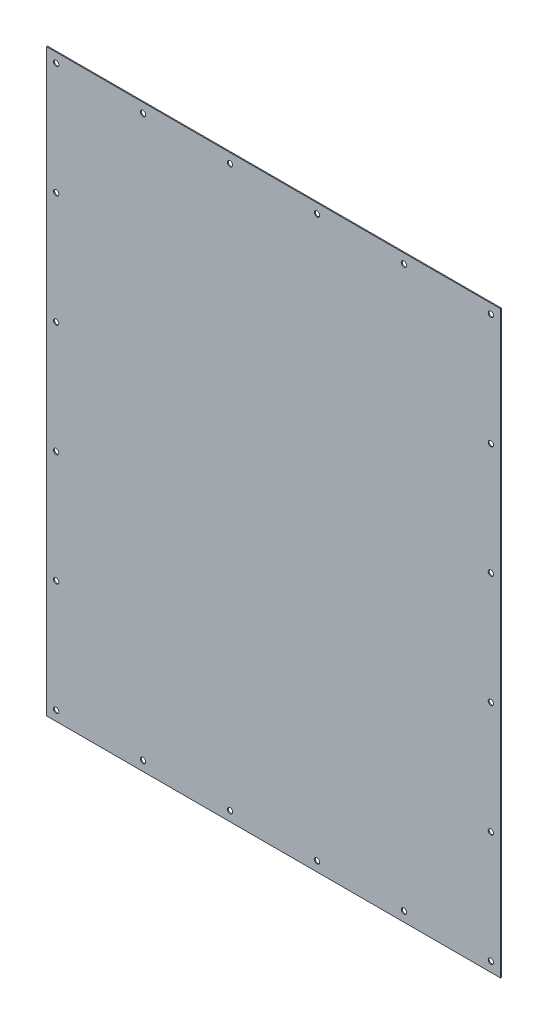
ISO-10303-21;
HEADER;
FILE_DESCRIPTION(('STEP AP214'),'2;1');
FILE_NAME('part.step','',(''),(''),'','','');
FILE_SCHEMA(('AUTOMOTIVE_DESIGN { 1 0 10303 214 1 1 1 1 }'));
ENDSEC;
DATA;
#1=APPLICATION_CONTEXT('core data for automotive mechanical design processes');
#2=APPLICATION_PROTOCOL_DEFINITION('international standard','automotive_design',2000,#1);
#3=PRODUCT_CONTEXT('',#1,'mechanical');
#4=PRODUCT('Part','Part','',(#3));
#5=PRODUCT_RELATED_PRODUCT_CATEGORY('part','',(#4));
#6=PRODUCT_DEFINITION_FORMATION('','',#4);
#7=PRODUCT_DEFINITION_CONTEXT('part definition',#1,'design');
#8=PRODUCT_DEFINITION('design','',#6,#7);
#9=PRODUCT_DEFINITION_SHAPE('','',#8);
#10=(LENGTH_UNIT() NAMED_UNIT(*) SI_UNIT(.MILLI.,.METRE.));
#11=(NAMED_UNIT(*) PLANE_ANGLE_UNIT() SI_UNIT($,.RADIAN.));
#12=(NAMED_UNIT(*) SI_UNIT($,.STERADIAN.) SOLID_ANGLE_UNIT());
#13=UNCERTAINTY_MEASURE_WITH_UNIT(LENGTH_MEASURE(1.E-05),#10,'distance_accuracy_value','');
#14=(GEOMETRIC_REPRESENTATION_CONTEXT(3) GLOBAL_UNCERTAINTY_ASSIGNED_CONTEXT((#13)) GLOBAL_UNIT_ASSIGNED_CONTEXT((#10,
#11,#12)) REPRESENTATION_CONTEXT('',''));
#15=CARTESIAN_POINT('',(0.,0.,0.));
#16=DIRECTION('',(0.,0.,1.));
#17=DIRECTION('',(1.,0.,0.));
#18=AXIS2_PLACEMENT_3D('',#15,#16,#17);
#19=CARTESIAN_POINT('',(0.,0.,0.));
#20=DIRECTION('',(0.,0.,-1.));
#21=DIRECTION('',(-1.,0.,0.));
#22=AXIS2_PLACEMENT_3D('',#19,#20,#21);
#23=PLANE('',#22);
#24=CARTESIAN_POINT('',(-135.,-290.,0.));
#25=DIRECTION('',(0.,0.,1.));
#26=DIRECTION('',(1.,0.,0.));
#27=AXIS2_PLACEMENT_3D('',#24,#25,#26);
#28=CIRCLE('',#27,2.74999999999997);
#29=CARTESIAN_POINT('',(-132.25,-290.,0.));
#30=VERTEX_POINT('',#29);
#31=EDGE_CURVE('E313',#30,#30,#28,.T.);
#32=ORIENTED_EDGE('',*,*,#31,.T.);
#33=EDGE_LOOP('',(#32));
#34=FACE_BOUND('',#33,.T.);
#35=CARTESIAN_POINT('',(-225.,-290.,0.));
#36=DIRECTION('',(0.,0.,1.));
#37=DIRECTION('',(1.,0.,0.));
#38=AXIS2_PLACEMENT_3D('',#35,#36,#37);
#39=CIRCLE('',#38,2.74999999999997);
#40=CARTESIAN_POINT('',(-222.25,-290.,0.));
#41=VERTEX_POINT('',#40);
#42=EDGE_CURVE('E318',#41,#41,#39,.T.);
#43=ORIENTED_EDGE('',*,*,#42,.T.);
#44=EDGE_LOOP('',(#43));
#45=FACE_BOUND('',#44,.T.);
#46=CARTESIAN_POINT('',(-225.,-174.,0.));
#47=DIRECTION('',(0.,0.,1.));
#48=DIRECTION('',(1.,0.,0.));
#49=AXIS2_PLACEMENT_3D('',#46,#47,#48);
#50=CIRCLE('',#49,2.74999999999997);
#51=CARTESIAN_POINT('',(-222.25,-174.,0.));
#52=VERTEX_POINT('',#51);
#53=EDGE_CURVE('E324',#52,#52,#50,.T.);
#54=ORIENTED_EDGE('',*,*,#53,.T.);
#55=EDGE_LOOP('',(#54));
#56=FACE_BOUND('',#55,.T.);
#57=CARTESIAN_POINT('',(-225.,-58.0000000000001,0.));
#58=DIRECTION('',(0.,0.,1.));
#59=DIRECTION('',(1.,0.,0.));
#60=AXIS2_PLACEMENT_3D('',#57,#58,#59);
#61=CIRCLE('',#60,2.74999999999997);
#62=CARTESIAN_POINT('',(-222.25,-58.0000000000001,0.));
#63=VERTEX_POINT('',#62);
#64=EDGE_CURVE('E330',#63,#63,#61,.T.);
#65=ORIENTED_EDGE('',*,*,#64,.T.);
#66=EDGE_LOOP('',(#65));
#67=FACE_BOUND('',#66,.T.);
#68=CARTESIAN_POINT('',(-225.,174.,0.));
#69=DIRECTION('',(0.,0.,1.));
#70=DIRECTION('',(1.,0.,0.));
#71=AXIS2_PLACEMENT_3D('',#68,#69,#70);
#72=CIRCLE('',#71,2.74999999999997);
#73=CARTESIAN_POINT('',(-222.25,174.,0.));
#74=VERTEX_POINT('',#73);
#75=EDGE_CURVE('E336',#74,#74,#72,.T.);
#76=ORIENTED_EDGE('',*,*,#75,.T.);
#77=EDGE_LOOP('',(#76));
#78=FACE_BOUND('',#77,.T.);
#79=CARTESIAN_POINT('',(-225.,57.9999999999999,0.));
#80=DIRECTION('',(0.,0.,1.));
#81=DIRECTION('',(1.,0.,0.));
#82=AXIS2_PLACEMENT_3D('',#79,#80,#81);
#83=CIRCLE('',#82,2.74999999999997);
#84=CARTESIAN_POINT('',(-222.25,57.9999999999999,0.));
#85=VERTEX_POINT('',#84);
#86=EDGE_CURVE('E109',#85,#85,#83,.T.);
#87=ORIENTED_EDGE('',*,*,#86,.T.);
#88=EDGE_LOOP('',(#87));
#89=FACE_BOUND('',#88,.T.);
#90=DIRECTION('',(0.,1.,0.));
#91=VECTOR('',#90,1.);
#92=CARTESIAN_POINT('',(-235.,-300.,0.));
#93=LINE('',#92,#91);
#94=CARTESIAN_POINT('',(-235.,-300.,0.));
#95=VERTEX_POINT('',#94);
#96=CARTESIAN_POINT('',(-235.,300.,0.));
#97=VERTEX_POINT('',#96);
#98=EDGE_CURVE('E105',#95,#97,#93,.T.);
#99=ORIENTED_EDGE('',*,*,#98,.T.);
#100=DIRECTION('',(1.,0.,0.));
#101=VECTOR('',#100,1.);
#102=CARTESIAN_POINT('',(-235.,300.,0.));
#103=LINE('',#102,#101);
#104=CARTESIAN_POINT('',(235.,300.,0.));
#105=VERTEX_POINT('',#104);
#106=EDGE_CURVE('E108',#97,#105,#103,.T.);
#107=ORIENTED_EDGE('',*,*,#106,.T.);
#108=DIRECTION('',(0.,1.,0.));
#109=VECTOR('',#108,1.);
#110=CARTESIAN_POINT('',(235.,-300.,0.));
#111=LINE('',#110,#109);
#112=CARTESIAN_POINT('',(235.,-300.,0.));
#113=VERTEX_POINT('',#112);
#114=EDGE_CURVE('E96',#113,#105,#111,.T.);
#115=ORIENTED_EDGE('',*,*,#114,.F.);
#116=DIRECTION('',(1.,0.,0.));
#117=VECTOR('',#116,1.);
#118=CARTESIAN_POINT('',(-235.,-300.,0.));
#119=LINE('',#118,#117);
#120=EDGE_CURVE('E71',#95,#113,#119,.T.);
#121=ORIENTED_EDGE('',*,*,#120,.F.);
#122=EDGE_LOOP('',(#99,#107,#115,#121));
#123=FACE_BOUND('',#122,.T.);
#124=CARTESIAN_POINT('',(-45.,-290.,0.));
#125=DIRECTION('',(0.,0.,1.));
#126=DIRECTION('',(1.,0.,0.));
#127=AXIS2_PLACEMENT_3D('',#124,#125,#126);
#128=CIRCLE('',#127,2.74999999999999);
#129=CARTESIAN_POINT('',(-42.2500000000001,-290.,0.));
#130=VERTEX_POINT('',#129);
#131=EDGE_CURVE('E307',#130,#130,#128,.T.);
#132=ORIENTED_EDGE('',*,*,#131,.T.);
#133=EDGE_LOOP('',(#132));
#134=FACE_BOUND('',#133,.T.);
#135=CARTESIAN_POINT('',(45.,-290.,0.));
#136=DIRECTION('',(0.,0.,1.));
#137=DIRECTION('',(1.,0.,0.));
#138=AXIS2_PLACEMENT_3D('',#135,#136,#137);
#139=CIRCLE('',#138,2.74999999999999);
#140=CARTESIAN_POINT('',(47.7499999999999,-290.,0.));
#141=VERTEX_POINT('',#140);
#142=EDGE_CURVE('E301',#141,#141,#139,.T.);
#143=ORIENTED_EDGE('',*,*,#142,.T.);
#144=EDGE_LOOP('',(#143));
#145=FACE_BOUND('',#144,.T.);
#146=CARTESIAN_POINT('',(135.,-290.,0.));
#147=DIRECTION('',(0.,0.,1.));
#148=DIRECTION('',(1.,0.,0.));
#149=AXIS2_PLACEMENT_3D('',#146,#147,#148);
#150=CIRCLE('',#149,2.74999999999997);
#151=CARTESIAN_POINT('',(137.75,-290.,0.));
#152=VERTEX_POINT('',#151);
#153=EDGE_CURVE('E295',#152,#152,#150,.T.);
#154=ORIENTED_EDGE('',*,*,#153,.T.);
#155=EDGE_LOOP('',(#154));
#156=FACE_BOUND('',#155,.T.);
#157=CARTESIAN_POINT('',(225.,-290.,0.));
#158=DIRECTION('',(0.,0.,1.));
#159=DIRECTION('',(1.,0.,0.));
#160=AXIS2_PLACEMENT_3D('',#157,#158,#159);
#161=CIRCLE('',#160,2.74999999999997);
#162=CARTESIAN_POINT('',(227.75,-290.,0.));
#163=VERTEX_POINT('',#162);
#164=EDGE_CURVE('E289',#163,#163,#161,.T.);
#165=ORIENTED_EDGE('',*,*,#164,.T.);
#166=EDGE_LOOP('',(#165));
#167=FACE_BOUND('',#166,.T.);
#168=CARTESIAN_POINT('',(225.,-174.,0.));
#169=DIRECTION('',(0.,0.,1.));
#170=DIRECTION('',(1.,0.,0.));
#171=AXIS2_PLACEMENT_3D('',#168,#169,#170);
#172=CIRCLE('',#171,2.74999999999997);
#173=CARTESIAN_POINT('',(227.75,-174.,0.));
#174=VERTEX_POINT('',#173);
#175=EDGE_CURVE('E283',#174,#174,#172,.T.);
#176=ORIENTED_EDGE('',*,*,#175,.T.);
#177=EDGE_LOOP('',(#176));
#178=FACE_BOUND('',#177,.T.);
#179=CARTESIAN_POINT('',(225.,-58.0000000000001,0.));
#180=DIRECTION('',(0.,0.,1.));
#181=DIRECTION('',(1.,0.,0.));
#182=AXIS2_PLACEMENT_3D('',#179,#180,#181);
#183=CIRCLE('',#182,2.74999999999997);
#184=CARTESIAN_POINT('',(227.75,-58.0000000000001,0.));
#185=VERTEX_POINT('',#184);
#186=EDGE_CURVE('E277',#185,#185,#183,.T.);
#187=ORIENTED_EDGE('',*,*,#186,.T.);
#188=EDGE_LOOP('',(#187));
#189=FACE_BOUND('',#188,.T.);
#190=CARTESIAN_POINT('',(225.,57.9999999999999,0.));
#191=DIRECTION('',(0.,0.,1.));
#192=DIRECTION('',(1.,0.,0.));
#193=AXIS2_PLACEMENT_3D('',#190,#191,#192);
#194=CIRCLE('',#193,2.74999999999997);
#195=CARTESIAN_POINT('',(227.75,57.9999999999999,0.));
#196=VERTEX_POINT('',#195);
#197=EDGE_CURVE('E271',#196,#196,#194,.T.);
#198=ORIENTED_EDGE('',*,*,#197,.T.);
#199=EDGE_LOOP('',(#198));
#200=FACE_BOUND('',#199,.T.);
#201=CARTESIAN_POINT('',(225.,174.,0.));
#202=DIRECTION('',(0.,0.,1.));
#203=DIRECTION('',(1.,0.,0.));
#204=AXIS2_PLACEMENT_3D('',#201,#202,#203);
#205=CIRCLE('',#204,2.74999999999997);
#206=CARTESIAN_POINT('',(227.75,174.,0.));
#207=VERTEX_POINT('',#206);
#208=EDGE_CURVE('E265',#207,#207,#205,.T.);
#209=ORIENTED_EDGE('',*,*,#208,.T.);
#210=EDGE_LOOP('',(#209));
#211=FACE_BOUND('',#210,.T.);
#212=CARTESIAN_POINT('',(225.,290.,0.));
#213=DIRECTION('',(0.,0.,1.));
#214=DIRECTION('',(1.,0.,0.));
#215=AXIS2_PLACEMENT_3D('',#212,#213,#214);
#216=CIRCLE('',#215,2.74999999999997);
#217=CARTESIAN_POINT('',(227.75,290.,0.));
#218=VERTEX_POINT('',#217);
#219=EDGE_CURVE('E259',#218,#218,#216,.T.);
#220=ORIENTED_EDGE('',*,*,#219,.T.);
#221=EDGE_LOOP('',(#220));
#222=FACE_BOUND('',#221,.T.);
#223=CARTESIAN_POINT('',(135.,290.,0.));
#224=DIRECTION('',(0.,0.,1.));
#225=DIRECTION('',(1.,0.,0.));
#226=AXIS2_PLACEMENT_3D('',#223,#224,#225);
#227=CIRCLE('',#226,2.74999999999997);
#228=CARTESIAN_POINT('',(137.75,290.,0.));
#229=VERTEX_POINT('',#228);
#230=EDGE_CURVE('E253',#229,#229,#227,.T.);
#231=ORIENTED_EDGE('',*,*,#230,.T.);
#232=EDGE_LOOP('',(#231));
#233=FACE_BOUND('',#232,.T.);
#234=CARTESIAN_POINT('',(45.,290.,0.));
#235=DIRECTION('',(0.,0.,1.));
#236=DIRECTION('',(1.,0.,0.));
#237=AXIS2_PLACEMENT_3D('',#234,#235,#236);
#238=CIRCLE('',#237,2.74999999999999);
#239=CARTESIAN_POINT('',(47.7499999999999,290.,0.));
#240=VERTEX_POINT('',#239);
#241=EDGE_CURVE('E247',#240,#240,#238,.T.);
#242=ORIENTED_EDGE('',*,*,#241,.T.);
#243=EDGE_LOOP('',(#242));
#244=FACE_BOUND('',#243,.T.);
#245=CARTESIAN_POINT('',(-45.,290.,0.));
#246=DIRECTION('',(0.,0.,1.));
#247=DIRECTION('',(1.,0.,0.));
#248=AXIS2_PLACEMENT_3D('',#245,#246,#247);
#249=CIRCLE('',#248,2.74999999999999);
#250=CARTESIAN_POINT('',(-42.25,290.,0.));
#251=VERTEX_POINT('',#250);
#252=EDGE_CURVE('E241',#251,#251,#249,.T.);
#253=ORIENTED_EDGE('',*,*,#252,.T.);
#254=EDGE_LOOP('',(#253));
#255=FACE_BOUND('',#254,.T.);
#256=CARTESIAN_POINT('',(-135.,290.,0.));
#257=DIRECTION('',(0.,0.,1.));
#258=DIRECTION('',(1.,0.,0.));
#259=AXIS2_PLACEMENT_3D('',#256,#257,#258);
#260=CIRCLE('',#259,2.74999999999997);
#261=CARTESIAN_POINT('',(-132.25,290.,0.));
#262=VERTEX_POINT('',#261);
#263=EDGE_CURVE('E235',#262,#262,#260,.T.);
#264=ORIENTED_EDGE('',*,*,#263,.T.);
#265=EDGE_LOOP('',(#264));
#266=FACE_BOUND('',#265,.T.);
#267=CARTESIAN_POINT('',(-225.,290.,0.));
#268=DIRECTION('',(0.,0.,1.));
#269=DIRECTION('',(1.,0.,0.));
#270=AXIS2_PLACEMENT_3D('',#267,#268,#269);
#271=CIRCLE('',#270,2.74999999999997);
#272=CARTESIAN_POINT('',(-222.25,290.,0.));
#273=VERTEX_POINT('',#272);
#274=EDGE_CURVE('E225',#273,#273,#271,.T.);
#275=ORIENTED_EDGE('',*,*,#274,.T.);
#276=EDGE_LOOP('',(#275));
#277=FACE_BOUND('',#276,.T.);
#278=ADVANCED_FACE('F37',(#34,#45,#56,#67,#78,#89,#123,#134,#145,#156,#167,#178,#189,#200,#211,
#222,#233,#244,#255,#266,#277),#23,.T.);
#279=CARTESIAN_POINT('',(0.,0.,1.));
#280=DIRECTION('',(0.,0.,-1.));
#281=DIRECTION('',(-1.,0.,0.));
#282=AXIS2_PLACEMENT_3D('',#279,#280,#281);
#283=PLANE('',#282);
#284=CARTESIAN_POINT('',(-225.,290.,1.));
#285=DIRECTION('',(0.,0.,1.));
#286=DIRECTION('',(1.,0.,0.));
#287=AXIS2_PLACEMENT_3D('',#284,#285,#286);
#288=CIRCLE('',#287,2.75);
#289=CARTESIAN_POINT('',(-222.25,290.,1.));
#290=VERTEX_POINT('',#289);
#291=EDGE_CURVE('E228',#290,#290,#288,.T.);
#292=ORIENTED_EDGE('',*,*,#291,.F.);
#293=EDGE_LOOP('',(#292));
#294=FACE_BOUND('',#293,.T.);
#295=CARTESIAN_POINT('',(-135.,290.,1.));
#296=DIRECTION('',(0.,0.,1.));
#297=DIRECTION('',(1.,0.,0.));
#298=AXIS2_PLACEMENT_3D('',#295,#296,#297);
#299=CIRCLE('',#298,2.75);
#300=CARTESIAN_POINT('',(-132.25,290.,1.));
#301=VERTEX_POINT('',#300);
#302=EDGE_CURVE('E230',#301,#301,#299,.T.);
#303=ORIENTED_EDGE('',*,*,#302,.F.);
#304=EDGE_LOOP('',(#303));
#305=FACE_BOUND('',#304,.T.);
#306=CARTESIAN_POINT('',(-45.,290.,1.));
#307=DIRECTION('',(0.,0.,1.));
#308=DIRECTION('',(1.,0.,0.));
#309=AXIS2_PLACEMENT_3D('',#306,#307,#308);
#310=CIRCLE('',#309,2.74999999999999);
#311=CARTESIAN_POINT('',(-42.25,290.,1.));
#312=VERTEX_POINT('',#311);
#313=EDGE_CURVE('E238',#312,#312,#310,.T.);
#314=ORIENTED_EDGE('',*,*,#313,.F.);
#315=EDGE_LOOP('',(#314));
#316=FACE_BOUND('',#315,.T.);
#317=CARTESIAN_POINT('',(45.,290.,1.));
#318=DIRECTION('',(0.,0.,1.));
#319=DIRECTION('',(1.,0.,0.));
#320=AXIS2_PLACEMENT_3D('',#317,#318,#319);
#321=CIRCLE('',#320,2.74999999999999);
#322=CARTESIAN_POINT('',(47.7499999999999,290.,1.));
#323=VERTEX_POINT('',#322);
#324=EDGE_CURVE('E244',#323,#323,#321,.T.);
#325=ORIENTED_EDGE('',*,*,#324,.F.);
#326=EDGE_LOOP('',(#325));
#327=FACE_BOUND('',#326,.T.);
#328=CARTESIAN_POINT('',(135.,290.,1.));
#329=DIRECTION('',(0.,0.,1.));
#330=DIRECTION('',(1.,0.,0.));
#331=AXIS2_PLACEMENT_3D('',#328,#329,#330);
#332=CIRCLE('',#331,2.74999999999997);
#333=CARTESIAN_POINT('',(137.75,290.,1.));
#334=VERTEX_POINT('',#333);
#335=EDGE_CURVE('E250',#334,#334,#332,.T.);
#336=ORIENTED_EDGE('',*,*,#335,.F.);
#337=EDGE_LOOP('',(#336));
#338=FACE_BOUND('',#337,.T.);
#339=CARTESIAN_POINT('',(225.,290.,1.));
#340=DIRECTION('',(0.,0.,1.));
#341=DIRECTION('',(1.,0.,0.));
#342=AXIS2_PLACEMENT_3D('',#339,#340,#341);
#343=CIRCLE('',#342,2.75);
#344=CARTESIAN_POINT('',(227.75,290.,1.));
#345=VERTEX_POINT('',#344);
#346=EDGE_CURVE('E256',#345,#345,#343,.T.);
#347=ORIENTED_EDGE('',*,*,#346,.F.);
#348=EDGE_LOOP('',(#347));
#349=FACE_BOUND('',#348,.T.);
#350=CARTESIAN_POINT('',(225.,174.,1.));
#351=DIRECTION('',(0.,0.,1.));
#352=DIRECTION('',(1.,0.,0.));
#353=AXIS2_PLACEMENT_3D('',#350,#351,#352);
#354=CIRCLE('',#353,2.74999999999997);
#355=CARTESIAN_POINT('',(227.75,174.,1.));
#356=VERTEX_POINT('',#355);
#357=EDGE_CURVE('E262',#356,#356,#354,.T.);
#358=ORIENTED_EDGE('',*,*,#357,.F.);
#359=EDGE_LOOP('',(#358));
#360=FACE_BOUND('',#359,.T.);
#361=CARTESIAN_POINT('',(225.,57.9999999999999,1.));
#362=DIRECTION('',(0.,0.,1.));
#363=DIRECTION('',(1.,0.,0.));
#364=AXIS2_PLACEMENT_3D('',#361,#362,#363);
#365=CIRCLE('',#364,2.74999999999997);
#366=CARTESIAN_POINT('',(227.75,57.9999999999999,1.));
#367=VERTEX_POINT('',#366);
#368=EDGE_CURVE('E268',#367,#367,#365,.T.);
#369=ORIENTED_EDGE('',*,*,#368,.F.);
#370=EDGE_LOOP('',(#369));
#371=FACE_BOUND('',#370,.T.);
#372=CARTESIAN_POINT('',(225.,-58.0000000000001,1.));
#373=DIRECTION('',(0.,0.,1.));
#374=DIRECTION('',(1.,0.,0.));
#375=AXIS2_PLACEMENT_3D('',#372,#373,#374);
#376=CIRCLE('',#375,2.74999999999997);
#377=CARTESIAN_POINT('',(227.75,-58.0000000000001,1.));
#378=VERTEX_POINT('',#377);
#379=EDGE_CURVE('E274',#378,#378,#376,.T.);
#380=ORIENTED_EDGE('',*,*,#379,.F.);
#381=EDGE_LOOP('',(#380));
#382=FACE_BOUND('',#381,.T.);
#383=CARTESIAN_POINT('',(225.,-174.,1.));
#384=DIRECTION('',(0.,0.,1.));
#385=DIRECTION('',(1.,0.,0.));
#386=AXIS2_PLACEMENT_3D('',#383,#384,#385);
#387=CIRCLE('',#386,2.74999999999997);
#388=CARTESIAN_POINT('',(227.75,-174.,1.));
#389=VERTEX_POINT('',#388);
#390=EDGE_CURVE('E280',#389,#389,#387,.T.);
#391=ORIENTED_EDGE('',*,*,#390,.F.);
#392=EDGE_LOOP('',(#391));
#393=FACE_BOUND('',#392,.T.);
#394=CARTESIAN_POINT('',(135.,-290.,1.));
#395=DIRECTION('',(0.,0.,1.));
#396=DIRECTION('',(1.,0.,0.));
#397=AXIS2_PLACEMENT_3D('',#394,#395,#396);
#398=CIRCLE('',#397,2.74999999999997);
#399=CARTESIAN_POINT('',(137.75,-290.,1.));
#400=VERTEX_POINT('',#399);
#401=EDGE_CURVE('E292',#400,#400,#398,.T.);
#402=ORIENTED_EDGE('',*,*,#401,.F.);
#403=EDGE_LOOP('',(#402));
#404=FACE_BOUND('',#403,.T.);
#405=CARTESIAN_POINT('',(45.,-290.,1.));
#406=DIRECTION('',(0.,0.,1.));
#407=DIRECTION('',(1.,0.,0.));
#408=AXIS2_PLACEMENT_3D('',#405,#406,#407);
#409=CIRCLE('',#408,2.74999999999999);
#410=CARTESIAN_POINT('',(47.7499999999999,-290.,1.));
#411=VERTEX_POINT('',#410);
#412=EDGE_CURVE('E298',#411,#411,#409,.T.);
#413=ORIENTED_EDGE('',*,*,#412,.F.);
#414=EDGE_LOOP('',(#413));
#415=FACE_BOUND('',#414,.T.);
#416=CARTESIAN_POINT('',(-45.,-290.,1.));
#417=DIRECTION('',(0.,0.,1.));
#418=DIRECTION('',(1.,0.,0.));
#419=AXIS2_PLACEMENT_3D('',#416,#417,#418);
#420=CIRCLE('',#419,2.74999999999999);
#421=CARTESIAN_POINT('',(-42.2500000000001,-290.,1.));
#422=VERTEX_POINT('',#421);
#423=EDGE_CURVE('E304',#422,#422,#420,.T.);
#424=ORIENTED_EDGE('',*,*,#423,.F.);
#425=EDGE_LOOP('',(#424));
#426=FACE_BOUND('',#425,.T.);
#427=CARTESIAN_POINT('',(-135.,-290.,1.));
#428=DIRECTION('',(0.,0.,1.));
#429=DIRECTION('',(1.,0.,0.));
#430=AXIS2_PLACEMENT_3D('',#427,#428,#429);
#431=CIRCLE('',#430,2.75);
#432=CARTESIAN_POINT('',(-132.25,-290.,1.));
#433=VERTEX_POINT('',#432);
#434=EDGE_CURVE('E310',#433,#433,#431,.T.);
#435=ORIENTED_EDGE('',*,*,#434,.F.);
#436=EDGE_LOOP('',(#435));
#437=FACE_BOUND('',#436,.T.);
#438=CARTESIAN_POINT('',(-225.,-290.,1.));
#439=DIRECTION('',(0.,0.,1.));
#440=DIRECTION('',(1.,0.,0.));
#441=AXIS2_PLACEMENT_3D('',#438,#439,#440);
#442=CIRCLE('',#441,2.75);
#443=CARTESIAN_POINT('',(-222.25,-290.,1.));
#444=VERTEX_POINT('',#443);
#445=EDGE_CURVE('E315',#444,#444,#442,.T.);
#446=ORIENTED_EDGE('',*,*,#445,.F.);
#447=EDGE_LOOP('',(#446));
#448=FACE_BOUND('',#447,.T.);
#449=CARTESIAN_POINT('',(-225.,-174.,1.));
#450=DIRECTION('',(0.,0.,1.));
#451=DIRECTION('',(1.,0.,0.));
#452=AXIS2_PLACEMENT_3D('',#449,#450,#451);
#453=CIRCLE('',#452,2.74999999999997);
#454=CARTESIAN_POINT('',(-222.25,-174.,1.));
#455=VERTEX_POINT('',#454);
#456=EDGE_CURVE('E321',#455,#455,#453,.T.);
#457=ORIENTED_EDGE('',*,*,#456,.F.);
#458=EDGE_LOOP('',(#457));
#459=FACE_BOUND('',#458,.T.);
#460=CARTESIAN_POINT('',(-225.,-58.0000000000001,1.));
#461=DIRECTION('',(0.,0.,1.));
#462=DIRECTION('',(1.,0.,0.));
#463=AXIS2_PLACEMENT_3D('',#460,#461,#462);
#464=CIRCLE('',#463,2.74999999999997);
#465=CARTESIAN_POINT('',(-222.25,-58.0000000000001,1.));
#466=VERTEX_POINT('',#465);
#467=EDGE_CURVE('E327',#466,#466,#464,.T.);
#468=ORIENTED_EDGE('',*,*,#467,.F.);
#469=EDGE_LOOP('',(#468));
#470=FACE_BOUND('',#469,.T.);
#471=CARTESIAN_POINT('',(-225.,174.,1.));
#472=DIRECTION('',(0.,0.,1.));
#473=DIRECTION('',(1.,0.,0.));
#474=AXIS2_PLACEMENT_3D('',#471,#472,#473);
#475=CIRCLE('',#474,2.74999999999997);
#476=CARTESIAN_POINT('',(-222.25,174.,1.));
#477=VERTEX_POINT('',#476);
#478=EDGE_CURVE('E333',#477,#477,#475,.T.);
#479=ORIENTED_EDGE('',*,*,#478,.F.);
#480=EDGE_LOOP('',(#479));
#481=FACE_BOUND('',#480,.T.);
#482=CARTESIAN_POINT('',(-225.,57.9999999999999,1.));
#483=DIRECTION('',(0.,0.,1.));
#484=DIRECTION('',(1.,0.,0.));
#485=AXIS2_PLACEMENT_3D('',#482,#483,#484);
#486=CIRCLE('',#485,2.74999999999997);
#487=CARTESIAN_POINT('',(-222.25,57.9999999999999,1.));
#488=VERTEX_POINT('',#487);
#489=EDGE_CURVE('E339',#488,#488,#486,.T.);
#490=ORIENTED_EDGE('',*,*,#489,.F.);
#491=EDGE_LOOP('',(#490));
#492=FACE_BOUND('',#491,.T.);
#493=DIRECTION('',(0.,1.,0.));
#494=VECTOR('',#493,1.);
#495=CARTESIAN_POINT('',(-235.,-300.,1.));
#496=LINE('',#495,#494);
#497=CARTESIAN_POINT('',(-235.,-300.,1.));
#498=VERTEX_POINT('',#497);
#499=CARTESIAN_POINT('',(-235.,300.,1.));
#500=VERTEX_POINT('',#499);
#501=EDGE_CURVE('E99',#498,#500,#496,.T.);
#502=ORIENTED_EDGE('',*,*,#501,.F.);
#503=DIRECTION('',(1.,0.,0.));
#504=VECTOR('',#503,1.);
#505=CARTESIAN_POINT('',(-235.,-300.,1.));
#506=LINE('',#505,#504);
#507=CARTESIAN_POINT('',(235.,-300.,1.));
#508=VERTEX_POINT('',#507);
#509=EDGE_CURVE('E89',#498,#508,#506,.T.);
#510=ORIENTED_EDGE('',*,*,#509,.T.);
#511=DIRECTION('',(0.,1.,0.));
#512=VECTOR('',#511,1.);
#513=CARTESIAN_POINT('',(235.,-300.,1.));
#514=LINE('',#513,#512);
#515=CARTESIAN_POINT('',(235.,300.,1.));
#516=VERTEX_POINT('',#515);
#517=EDGE_CURVE('E83',#508,#516,#514,.T.);
#518=ORIENTED_EDGE('',*,*,#517,.T.);
#519=DIRECTION('',(1.,0.,0.));
#520=VECTOR('',#519,1.);
#521=CARTESIAN_POINT('',(-235.,300.,1.));
#522=LINE('',#521,#520);
#523=EDGE_CURVE('E88',#500,#516,#522,.T.);
#524=ORIENTED_EDGE('',*,*,#523,.F.);
#525=EDGE_LOOP('',(#502,#510,#518,#524));
#526=FACE_BOUND('',#525,.T.);
#527=CARTESIAN_POINT('',(225.,-290.,1.));
#528=DIRECTION('',(0.,0.,1.));
#529=DIRECTION('',(1.,0.,0.));
#530=AXIS2_PLACEMENT_3D('',#527,#528,#529);
#531=CIRCLE('',#530,2.75);
#532=CARTESIAN_POINT('',(227.75,-290.,1.));
#533=VERTEX_POINT('',#532);
#534=EDGE_CURVE('E286',#533,#533,#531,.T.);
#535=ORIENTED_EDGE('',*,*,#534,.F.);
#536=EDGE_LOOP('',(#535));
#537=FACE_BOUND('',#536,.T.);
#538=ADVANCED_FACE('F86',(#294,#305,#316,#327,#338,#349,#360,#371,#382,#393,#404,#415,#426,#437,
#448,#459,#470,#481,#492,#526,#537),#283,.F.);
#539=CARTESIAN_POINT('',(-235.,-300.,1.));
#540=DIRECTION('',(-1.,0.,0.));
#541=DIRECTION('',(0.,0.,1.));
#542=AXIS2_PLACEMENT_3D('',#539,#540,#541);
#543=PLANE('',#542);
#544=ORIENTED_EDGE('',*,*,#98,.F.);
#545=DIRECTION('',(0.,0.,-1.));
#546=VECTOR('',#545,1.);
#547=CARTESIAN_POINT('',(-235.,-300.,1.));
#548=LINE('',#547,#546);
#549=EDGE_CURVE('E11',#498,#95,#548,.T.);
#550=ORIENTED_EDGE('',*,*,#549,.F.);
#551=ORIENTED_EDGE('',*,*,#501,.T.);
#552=DIRECTION('',(0.,0.,-1.));
#553=VECTOR('',#552,1.);
#554=CARTESIAN_POINT('',(-235.,300.,1.));
#555=LINE('',#554,#553);
#556=EDGE_CURVE('E41',#500,#97,#555,.T.);
#557=ORIENTED_EDGE('',*,*,#556,.T.);
#558=EDGE_LOOP('',(#544,#550,#551,#557));
#559=FACE_BOUND('',#558,.T.);
#560=ADVANCED_FACE('F39',(#559),#543,.T.);
#561=CARTESIAN_POINT('',(-235.,-300.,1.));
#562=DIRECTION('',(0.,1.,0.));
#563=DIRECTION('',(0.,0.,1.));
#564=AXIS2_PLACEMENT_3D('',#561,#562,#563);
#565=PLANE('',#564);
#566=ORIENTED_EDGE('',*,*,#120,.T.);
#567=DIRECTION('',(0.,0.,-1.));
#568=VECTOR('',#567,1.);
#569=CARTESIAN_POINT('',(235.,-300.,1.));
#570=LINE('',#569,#568);
#571=EDGE_CURVE('E47',#508,#113,#570,.T.);
#572=ORIENTED_EDGE('',*,*,#571,.F.);
#573=ORIENTED_EDGE('',*,*,#509,.F.);
#574=ORIENTED_EDGE('',*,*,#549,.T.);
#575=EDGE_LOOP('',(#566,#572,#573,#574));
#576=FACE_BOUND('',#575,.T.);
#577=ADVANCED_FACE('F116',(#576),#565,.F.);
#578=CARTESIAN_POINT('',(235.,-300.,1.));
#579=DIRECTION('',(-1.,0.,0.));
#580=DIRECTION('',(0.,0.,1.));
#581=AXIS2_PLACEMENT_3D('',#578,#579,#580);
#582=PLANE('',#581);
#583=ORIENTED_EDGE('',*,*,#114,.T.);
#584=DIRECTION('',(0.,0.,-1.));
#585=VECTOR('',#584,1.);
#586=CARTESIAN_POINT('',(235.,300.,1.));
#587=LINE('',#586,#585);
#588=EDGE_CURVE('E93',#516,#105,#587,.T.);
#589=ORIENTED_EDGE('',*,*,#588,.F.);
#590=ORIENTED_EDGE('',*,*,#517,.F.);
#591=ORIENTED_EDGE('',*,*,#571,.T.);
#592=EDGE_LOOP('',(#583,#589,#590,#591));
#593=FACE_BOUND('',#592,.T.);
#594=ADVANCED_FACE('F94',(#593),#582,.F.);
#595=CARTESIAN_POINT('',(-235.,300.,1.));
#596=DIRECTION('',(0.,1.,0.));
#597=DIRECTION('',(0.,0.,1.));
#598=AXIS2_PLACEMENT_3D('',#595,#596,#597);
#599=PLANE('',#598);
#600=ORIENTED_EDGE('',*,*,#106,.F.);
#601=ORIENTED_EDGE('',*,*,#556,.F.);
#602=ORIENTED_EDGE('',*,*,#523,.T.);
#603=ORIENTED_EDGE('',*,*,#588,.T.);
#604=EDGE_LOOP('',(#600,#601,#602,#603));
#605=FACE_BOUND('',#604,.T.);
#606=ADVANCED_FACE('F98',(#605),#599,.T.);
#607=CARTESIAN_POINT('',(-225.,57.9999999999999,1.));
#608=DIRECTION('',(0.,0.,1.));
#609=DIRECTION('',(1.,0.,0.));
#610=AXIS2_PLACEMENT_3D('',#607,#608,#609);
#611=CYLINDRICAL_SURFACE('',#610,2.74999999999997);
#612=ORIENTED_EDGE('',*,*,#86,.F.);
#613=EDGE_LOOP('',(#612));
#614=FACE_BOUND('',#613,.T.);
#615=ORIENTED_EDGE('',*,*,#489,.T.);
#616=EDGE_LOOP('',(#615));
#617=FACE_BOUND('',#616,.T.);
#618=ADVANCED_FACE('F135',(#614,#617),#611,.F.);
#619=CARTESIAN_POINT('',(-225.,174.,1.));
#620=DIRECTION('',(0.,0.,1.));
#621=DIRECTION('',(1.,0.,0.));
#622=AXIS2_PLACEMENT_3D('',#619,#620,#621);
#623=CYLINDRICAL_SURFACE('',#622,2.74999999999997);
#624=ORIENTED_EDGE('',*,*,#75,.F.);
#625=EDGE_LOOP('',(#624));
#626=FACE_BOUND('',#625,.T.);
#627=ORIENTED_EDGE('',*,*,#478,.T.);
#628=EDGE_LOOP('',(#627));
#629=FACE_BOUND('',#628,.T.);
#630=ADVANCED_FACE('F139',(#626,#629),#623,.F.);
#631=CARTESIAN_POINT('',(-225.,-58.0000000000001,1.));
#632=DIRECTION('',(0.,0.,1.));
#633=DIRECTION('',(1.,0.,0.));
#634=AXIS2_PLACEMENT_3D('',#631,#632,#633);
#635=CYLINDRICAL_SURFACE('',#634,2.74999999999997);
#636=ORIENTED_EDGE('',*,*,#64,.F.);
#637=EDGE_LOOP('',(#636));
#638=FACE_BOUND('',#637,.T.);
#639=ORIENTED_EDGE('',*,*,#467,.T.);
#640=EDGE_LOOP('',(#639));
#641=FACE_BOUND('',#640,.T.);
#642=ADVANCED_FACE('F144',(#638,#641),#635,.F.);
#643=CARTESIAN_POINT('',(-225.,-174.,1.));
#644=DIRECTION('',(0.,0.,1.));
#645=DIRECTION('',(1.,0.,0.));
#646=AXIS2_PLACEMENT_3D('',#643,#644,#645);
#647=CYLINDRICAL_SURFACE('',#646,2.74999999999997);
#648=ORIENTED_EDGE('',*,*,#53,.F.);
#649=EDGE_LOOP('',(#648));
#650=FACE_BOUND('',#649,.T.);
#651=ORIENTED_EDGE('',*,*,#456,.T.);
#652=EDGE_LOOP('',(#651));
#653=FACE_BOUND('',#652,.T.);
#654=ADVANCED_FACE('F152',(#650,#653),#647,.F.);
#655=CARTESIAN_POINT('',(-225.,-290.,1.));
#656=DIRECTION('',(0.,0.,1.));
#657=DIRECTION('',(1.,0.,0.));
#658=AXIS2_PLACEMENT_3D('',#655,#656,#657);
#659=CYLINDRICAL_SURFACE('',#658,2.74999999999999);
#660=ORIENTED_EDGE('',*,*,#42,.F.);
#661=EDGE_LOOP('',(#660));
#662=FACE_BOUND('',#661,.T.);
#663=ORIENTED_EDGE('',*,*,#445,.T.);
#664=EDGE_LOOP('',(#663));
#665=FACE_BOUND('',#664,.T.);
#666=ADVANCED_FACE('F156',(#662,#665),#659,.F.);
#667=CARTESIAN_POINT('',(-135.,-290.,1.));
#668=DIRECTION('',(0.,0.,1.));
#669=DIRECTION('',(1.,0.,0.));
#670=AXIS2_PLACEMENT_3D('',#667,#668,#669);
#671=CYLINDRICAL_SURFACE('',#670,2.74999999999999);
#672=ORIENTED_EDGE('',*,*,#31,.F.);
#673=EDGE_LOOP('',(#672));
#674=FACE_BOUND('',#673,.T.);
#675=ORIENTED_EDGE('',*,*,#434,.T.);
#676=EDGE_LOOP('',(#675));
#677=FACE_BOUND('',#676,.T.);
#678=ADVANCED_FACE('F160',(#674,#677),#671,.F.);
#679=CARTESIAN_POINT('',(-45.,-290.,1.));
#680=DIRECTION('',(0.,0.,1.));
#681=DIRECTION('',(1.,0.,0.));
#682=AXIS2_PLACEMENT_3D('',#679,#680,#681);
#683=CYLINDRICAL_SURFACE('',#682,2.74999999999999);
#684=ORIENTED_EDGE('',*,*,#131,.F.);
#685=EDGE_LOOP('',(#684));
#686=FACE_BOUND('',#685,.T.);
#687=ORIENTED_EDGE('',*,*,#423,.T.);
#688=EDGE_LOOP('',(#687));
#689=FACE_BOUND('',#688,.T.);
#690=ADVANCED_FACE('F164',(#686,#689),#683,.F.);
#691=CARTESIAN_POINT('',(45.,-290.,1.));
#692=DIRECTION('',(0.,0.,1.));
#693=DIRECTION('',(1.,0.,0.));
#694=AXIS2_PLACEMENT_3D('',#691,#692,#693);
#695=CYLINDRICAL_SURFACE('',#694,2.74999999999999);
#696=ORIENTED_EDGE('',*,*,#142,.F.);
#697=EDGE_LOOP('',(#696));
#698=FACE_BOUND('',#697,.T.);
#699=ORIENTED_EDGE('',*,*,#412,.T.);
#700=EDGE_LOOP('',(#699));
#701=FACE_BOUND('',#700,.T.);
#702=ADVANCED_FACE('F168',(#698,#701),#695,.F.);
#703=CARTESIAN_POINT('',(135.,-290.,1.));
#704=DIRECTION('',(0.,0.,1.));
#705=DIRECTION('',(1.,0.,0.));
#706=AXIS2_PLACEMENT_3D('',#703,#704,#705);
#707=CYLINDRICAL_SURFACE('',#706,2.74999999999997);
#708=ORIENTED_EDGE('',*,*,#153,.F.);
#709=EDGE_LOOP('',(#708));
#710=FACE_BOUND('',#709,.T.);
#711=ORIENTED_EDGE('',*,*,#401,.T.);
#712=EDGE_LOOP('',(#711));
#713=FACE_BOUND('',#712,.T.);
#714=ADVANCED_FACE('F172',(#710,#713),#707,.F.);
#715=CARTESIAN_POINT('',(225.,-290.,1.));
#716=DIRECTION('',(0.,0.,1.));
#717=DIRECTION('',(1.,0.,0.));
#718=AXIS2_PLACEMENT_3D('',#715,#716,#717);
#719=CYLINDRICAL_SURFACE('',#718,2.74999999999999);
#720=ORIENTED_EDGE('',*,*,#164,.F.);
#721=EDGE_LOOP('',(#720));
#722=FACE_BOUND('',#721,.T.);
#723=ORIENTED_EDGE('',*,*,#534,.T.);
#724=EDGE_LOOP('',(#723));
#725=FACE_BOUND('',#724,.T.);
#726=ADVANCED_FACE('F176',(#722,#725),#719,.F.);
#727=CARTESIAN_POINT('',(225.,-174.,1.));
#728=DIRECTION('',(0.,0.,1.));
#729=DIRECTION('',(1.,0.,0.));
#730=AXIS2_PLACEMENT_3D('',#727,#728,#729);
#731=CYLINDRICAL_SURFACE('',#730,2.74999999999997);
#732=ORIENTED_EDGE('',*,*,#175,.F.);
#733=EDGE_LOOP('',(#732));
#734=FACE_BOUND('',#733,.T.);
#735=ORIENTED_EDGE('',*,*,#390,.T.);
#736=EDGE_LOOP('',(#735));
#737=FACE_BOUND('',#736,.T.);
#738=ADVANCED_FACE('F180',(#734,#737),#731,.F.);
#739=CARTESIAN_POINT('',(225.,-58.0000000000001,1.));
#740=DIRECTION('',(0.,0.,1.));
#741=DIRECTION('',(1.,0.,0.));
#742=AXIS2_PLACEMENT_3D('',#739,#740,#741);
#743=CYLINDRICAL_SURFACE('',#742,2.74999999999997);
#744=ORIENTED_EDGE('',*,*,#186,.F.);
#745=EDGE_LOOP('',(#744));
#746=FACE_BOUND('',#745,.T.);
#747=ORIENTED_EDGE('',*,*,#379,.T.);
#748=EDGE_LOOP('',(#747));
#749=FACE_BOUND('',#748,.T.);
#750=ADVANCED_FACE('F184',(#746,#749),#743,.F.);
#751=CARTESIAN_POINT('',(225.,57.9999999999999,1.));
#752=DIRECTION('',(0.,0.,1.));
#753=DIRECTION('',(1.,0.,0.));
#754=AXIS2_PLACEMENT_3D('',#751,#752,#753);
#755=CYLINDRICAL_SURFACE('',#754,2.74999999999997);
#756=ORIENTED_EDGE('',*,*,#197,.F.);
#757=EDGE_LOOP('',(#756));
#758=FACE_BOUND('',#757,.T.);
#759=ORIENTED_EDGE('',*,*,#368,.T.);
#760=EDGE_LOOP('',(#759));
#761=FACE_BOUND('',#760,.T.);
#762=ADVANCED_FACE('F188',(#758,#761),#755,.F.);
#763=CARTESIAN_POINT('',(225.,174.,1.));
#764=DIRECTION('',(0.,0.,1.));
#765=DIRECTION('',(1.,0.,0.));
#766=AXIS2_PLACEMENT_3D('',#763,#764,#765);
#767=CYLINDRICAL_SURFACE('',#766,2.74999999999997);
#768=ORIENTED_EDGE('',*,*,#208,.F.);
#769=EDGE_LOOP('',(#768));
#770=FACE_BOUND('',#769,.T.);
#771=ORIENTED_EDGE('',*,*,#357,.T.);
#772=EDGE_LOOP('',(#771));
#773=FACE_BOUND('',#772,.T.);
#774=ADVANCED_FACE('F192',(#770,#773),#767,.F.);
#775=CARTESIAN_POINT('',(225.,290.,1.));
#776=DIRECTION('',(0.,0.,1.));
#777=DIRECTION('',(1.,0.,0.));
#778=AXIS2_PLACEMENT_3D('',#775,#776,#777);
#779=CYLINDRICAL_SURFACE('',#778,2.74999999999999);
#780=ORIENTED_EDGE('',*,*,#219,.F.);
#781=EDGE_LOOP('',(#780));
#782=FACE_BOUND('',#781,.T.);
#783=ORIENTED_EDGE('',*,*,#346,.T.);
#784=EDGE_LOOP('',(#783));
#785=FACE_BOUND('',#784,.T.);
#786=ADVANCED_FACE('F196',(#782,#785),#779,.F.);
#787=CARTESIAN_POINT('',(135.,290.,1.));
#788=DIRECTION('',(0.,0.,1.));
#789=DIRECTION('',(1.,0.,0.));
#790=AXIS2_PLACEMENT_3D('',#787,#788,#789);
#791=CYLINDRICAL_SURFACE('',#790,2.74999999999997);
#792=ORIENTED_EDGE('',*,*,#230,.F.);
#793=EDGE_LOOP('',(#792));
#794=FACE_BOUND('',#793,.T.);
#795=ORIENTED_EDGE('',*,*,#335,.T.);
#796=EDGE_LOOP('',(#795));
#797=FACE_BOUND('',#796,.T.);
#798=ADVANCED_FACE('F200',(#794,#797),#791,.F.);
#799=CARTESIAN_POINT('',(45.,290.,1.));
#800=DIRECTION('',(0.,0.,1.));
#801=DIRECTION('',(1.,0.,0.));
#802=AXIS2_PLACEMENT_3D('',#799,#800,#801);
#803=CYLINDRICAL_SURFACE('',#802,2.74999999999999);
#804=ORIENTED_EDGE('',*,*,#241,.F.);
#805=EDGE_LOOP('',(#804));
#806=FACE_BOUND('',#805,.T.);
#807=ORIENTED_EDGE('',*,*,#324,.T.);
#808=EDGE_LOOP('',(#807));
#809=FACE_BOUND('',#808,.T.);
#810=ADVANCED_FACE('F204',(#806,#809),#803,.F.);
#811=CARTESIAN_POINT('',(-45.,290.,1.));
#812=DIRECTION('',(0.,0.,1.));
#813=DIRECTION('',(1.,0.,0.));
#814=AXIS2_PLACEMENT_3D('',#811,#812,#813);
#815=CYLINDRICAL_SURFACE('',#814,2.74999999999999);
#816=ORIENTED_EDGE('',*,*,#252,.F.);
#817=EDGE_LOOP('',(#816));
#818=FACE_BOUND('',#817,.T.);
#819=ORIENTED_EDGE('',*,*,#313,.T.);
#820=EDGE_LOOP('',(#819));
#821=FACE_BOUND('',#820,.T.);
#822=ADVANCED_FACE('F208',(#818,#821),#815,.F.);
#823=CARTESIAN_POINT('',(-135.,290.,1.));
#824=DIRECTION('',(0.,0.,1.));
#825=DIRECTION('',(1.,0.,0.));
#826=AXIS2_PLACEMENT_3D('',#823,#824,#825);
#827=CYLINDRICAL_SURFACE('',#826,2.74999999999999);
#828=ORIENTED_EDGE('',*,*,#263,.F.);
#829=EDGE_LOOP('',(#828));
#830=FACE_BOUND('',#829,.T.);
#831=ORIENTED_EDGE('',*,*,#302,.T.);
#832=EDGE_LOOP('',(#831));
#833=FACE_BOUND('',#832,.T.);
#834=ADVANCED_FACE('F212',(#830,#833),#827,.F.);
#835=CARTESIAN_POINT('',(-225.,290.,1.));
#836=DIRECTION('',(0.,0.,1.));
#837=DIRECTION('',(1.,0.,0.));
#838=AXIS2_PLACEMENT_3D('',#835,#836,#837);
#839=CYLINDRICAL_SURFACE('',#838,2.74999999999999);
#840=ORIENTED_EDGE('',*,*,#274,.F.);
#841=EDGE_LOOP('',(#840));
#842=FACE_BOUND('',#841,.T.);
#843=ORIENTED_EDGE('',*,*,#291,.T.);
#844=EDGE_LOOP('',(#843));
#845=FACE_BOUND('',#844,.T.);
#846=ADVANCED_FACE('F216',(#842,#845),#839,.F.);
#847=CLOSED_SHELL('',(#278,#538,#560,#577,#594,#606,#618,#630,#642,#654,#666,#678,#690,#702,
#714,#726,#738,#750,#762,#774,#786,#798,#810,#822,#834,#846));
#848=MANIFOLD_SOLID_BREP('B2',#847);
#849=ADVANCED_BREP_SHAPE_REPRESENTATION('',(#18,#848),#14);
#850=SHAPE_DEFINITION_REPRESENTATION(#9,#849);
ENDSEC;
END-ISO-10303-21;
